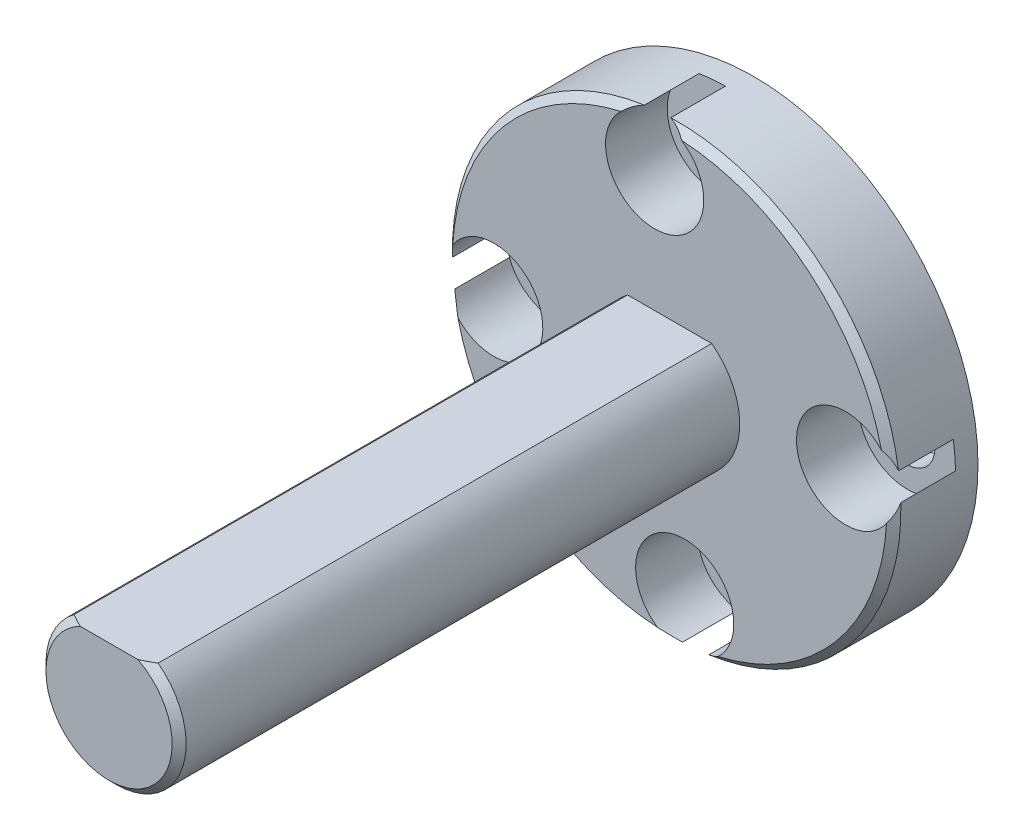
ISO-10303-21;
HEADER;
FILE_DESCRIPTION(('STEP AP214'),'2;1');
FILE_NAME('part.step','',(''),(''),'','','');
FILE_SCHEMA(('AUTOMOTIVE_DESIGN { 1 0 10303 214 1 1 1 1 }'));
ENDSEC;
DATA;
#1=APPLICATION_CONTEXT('core data for automotive mechanical design processes');
#2=APPLICATION_PROTOCOL_DEFINITION('international standard','automotive_design',2000,#1);
#3=PRODUCT_CONTEXT('',#1,'mechanical');
#4=PRODUCT('Part','Part','',(#3));
#5=PRODUCT_RELATED_PRODUCT_CATEGORY('part','',(#4));
#6=PRODUCT_DEFINITION_FORMATION('','',#4);
#7=PRODUCT_DEFINITION_CONTEXT('part definition',#1,'design');
#8=PRODUCT_DEFINITION('design','',#6,#7);
#9=PRODUCT_DEFINITION_SHAPE('','',#8);
#10=(LENGTH_UNIT() NAMED_UNIT(*) SI_UNIT(.MILLI.,.METRE.));
#11=(NAMED_UNIT(*) PLANE_ANGLE_UNIT() SI_UNIT($,.RADIAN.));
#12=(NAMED_UNIT(*) SI_UNIT($,.STERADIAN.) SOLID_ANGLE_UNIT());
#13=UNCERTAINTY_MEASURE_WITH_UNIT(LENGTH_MEASURE(1.E-05),#10,'distance_accuracy_value','');
#14=(GEOMETRIC_REPRESENTATION_CONTEXT(3) GLOBAL_UNCERTAINTY_ASSIGNED_CONTEXT((#13)) GLOBAL_UNIT_ASSIGNED_CONTEXT((#10,
#11,#12)) REPRESENTATION_CONTEXT('',''));
#15=CARTESIAN_POINT('',(0.,0.,0.));
#16=DIRECTION('',(0.,0.,1.));
#17=DIRECTION('',(1.,0.,0.));
#18=AXIS2_PLACEMENT_3D('',#15,#16,#17);
#19=CARTESIAN_POINT('',(8.5894589271742,-9.33447774890565,3.81));
#20=DIRECTION('',(0.,0.,-1.));
#21=DIRECTION('',(-1.,0.,0.));
#22=AXIS2_PLACEMENT_3D('',#19,#20,#21);
#23=CYLINDRICAL_SURFACE('',#22,1.25);
#24=CARTESIAN_POINT('',(8.5894589271742,-9.33447774890565,0.));
#25=DIRECTION('',(0.,0.,1.));
#26=DIRECTION('',(1.,0.,0.));
#27=AXIS2_PLACEMENT_3D('',#24,#25,#26);
#28=CIRCLE('',#27,1.25);
#29=CARTESIAN_POINT('',(9.8394589271742,-9.33447774890565,0.));
#30=VERTEX_POINT('',#29);
#31=EDGE_CURVE('E380',#30,#30,#28,.T.);
#32=ORIENTED_EDGE('',*,*,#31,.F.);
#33=EDGE_LOOP('',(#32));
#34=FACE_BOUND('',#33,.T.);
#35=CARTESIAN_POINT('',(8.5894589271742,-9.33447774890565,1.016));
#36=DIRECTION('',(0.,0.,1.));
#37=DIRECTION('',(1.,0.,0.));
#38=AXIS2_PLACEMENT_3D('',#35,#36,#37);
#39=CIRCLE('',#38,1.25);
#40=CARTESIAN_POINT('',(9.8394589271742,-9.33447774890565,1.016));
#41=VERTEX_POINT('',#40);
#42=EDGE_CURVE('E46',#41,#41,#39,.T.);
#43=ORIENTED_EDGE('',*,*,#42,.T.);
#44=EDGE_LOOP('',(#43));
#45=FACE_BOUND('',#44,.T.);
#46=ADVANCED_FACE('F40',(#34,#45),#23,.F.);
#47=CARTESIAN_POINT('',(1.29894533631494,-17.9859753985324,3.81));
#48=DIRECTION('',(0.,0.,-1.));
#49=DIRECTION('',(-1.,0.,0.));
#50=AXIS2_PLACEMENT_3D('',#47,#48,#49);
#51=CYLINDRICAL_SURFACE('',#50,1.25);
#52=CARTESIAN_POINT('',(1.29894533631494,-17.9859753985324,0.));
#53=DIRECTION('',(0.,0.,1.));
#54=DIRECTION('',(1.,0.,0.));
#55=AXIS2_PLACEMENT_3D('',#52,#53,#54);
#56=CIRCLE('',#55,1.25);
#57=CARTESIAN_POINT('',(2.54894533631494,-17.9859753985324,0.));
#58=VERTEX_POINT('',#57);
#59=EDGE_CURVE('E378',#58,#58,#56,.T.);
#60=ORIENTED_EDGE('',*,*,#59,.F.);
#61=EDGE_LOOP('',(#60));
#62=FACE_BOUND('',#61,.T.);
#63=CARTESIAN_POINT('',(1.29894533631494,-17.9859753985324,1.016));
#64=DIRECTION('',(0.,0.,1.));
#65=DIRECTION('',(1.,0.,0.));
#66=AXIS2_PLACEMENT_3D('',#63,#64,#65);
#67=CIRCLE('',#66,1.25);
#68=CARTESIAN_POINT('',(2.54894533631494,-17.9859753985324,1.016));
#69=VERTEX_POINT('',#68);
#70=EDGE_CURVE('E428',#69,#69,#67,.T.);
#71=ORIENTED_EDGE('',*,*,#70,.T.);
#72=EDGE_LOOP('',(#71));
#73=FACE_BOUND('',#72,.T.);
#74=ADVANCED_FACE('F231',(#62,#73),#51,.F.);
#75=CARTESIAN_POINT('',(-7.35255231331176,-10.6954618076731,3.81));
#76=DIRECTION('',(0.,0.,-1.));
#77=DIRECTION('',(-1.,0.,0.));
#78=AXIS2_PLACEMENT_3D('',#75,#76,#77);
#79=CYLINDRICAL_SURFACE('',#78,1.25);
#80=CARTESIAN_POINT('',(-7.35255231331176,-10.6954618076731,0.));
#81=DIRECTION('',(0.,0.,1.));
#82=DIRECTION('',(1.,0.,0.));
#83=AXIS2_PLACEMENT_3D('',#80,#81,#82);
#84=CIRCLE('',#83,1.25);
#85=CARTESIAN_POINT('',(-6.10255231331177,-10.6954618076731,0.));
#86=VERTEX_POINT('',#85);
#87=EDGE_CURVE('E375',#86,#86,#84,.T.);
#88=ORIENTED_EDGE('',*,*,#87,.F.);
#89=EDGE_LOOP('',(#88));
#90=FACE_BOUND('',#89,.T.);
#91=CARTESIAN_POINT('',(-7.35255231331176,-10.6954618076731,1.016));
#92=DIRECTION('',(0.,0.,1.));
#93=DIRECTION('',(1.,0.,0.));
#94=AXIS2_PLACEMENT_3D('',#91,#92,#93);
#95=CIRCLE('',#94,1.25);
#96=CARTESIAN_POINT('',(-6.10255231331177,-10.6954618076731,1.016));
#97=VERTEX_POINT('',#96);
#98=EDGE_CURVE('E425',#97,#97,#95,.T.);
#99=ORIENTED_EDGE('',*,*,#98,.T.);
#100=EDGE_LOOP('',(#99));
#101=FACE_BOUND('',#100,.T.);
#102=ADVANCED_FACE('F227',(#90,#101),#79,.F.);
#103=CARTESIAN_POINT('',(-0.0620387224524936,-2.04396415804638,3.81));
#104=DIRECTION('',(0.,0.,-1.));
#105=DIRECTION('',(-1.,0.,0.));
#106=AXIS2_PLACEMENT_3D('',#103,#104,#105);
#107=CYLINDRICAL_SURFACE('',#106,1.25000000000001);
#108=CARTESIAN_POINT('',(-0.0620387224524936,-2.04396415804638,0.));
#109=DIRECTION('',(0.,0.,1.));
#110=DIRECTION('',(1.,0.,0.));
#111=AXIS2_PLACEMENT_3D('',#108,#109,#110);
#112=CIRCLE('',#111,1.25000000000001);
#113=CARTESIAN_POINT('',(1.18796127754751,-2.04396415804638,0.));
#114=VERTEX_POINT('',#113);
#115=EDGE_CURVE('E372',#114,#114,#112,.T.);
#116=ORIENTED_EDGE('',*,*,#115,.F.);
#117=EDGE_LOOP('',(#116));
#118=FACE_BOUND('',#117,.T.);
#119=CARTESIAN_POINT('',(-0.0620387224524936,-2.04396415804638,1.016));
#120=DIRECTION('',(0.,0.,1.));
#121=DIRECTION('',(1.,0.,0.));
#122=AXIS2_PLACEMENT_3D('',#119,#120,#121);
#123=CIRCLE('',#122,1.25000000000001);
#124=CARTESIAN_POINT('',(1.18796127754751,-2.04396415804638,1.016));
#125=VERTEX_POINT('',#124);
#126=EDGE_CURVE('E422',#125,#125,#123,.T.);
#127=ORIENTED_EDGE('',*,*,#126,.T.);
#128=EDGE_LOOP('',(#127));
#129=FACE_BOUND('',#128,.T.);
#130=ADVANCED_FACE('F223',(#118,#129),#107,.F.);
#131=CARTESIAN_POINT('',(0.618453306931221,-10.0149697782894,3.81));
#132=DIRECTION('',(0.,0.,-1.));
#133=DIRECTION('',(-1.,0.,0.));
#134=AXIS2_PLACEMENT_3D('',#131,#132,#133);
#135=CONICAL_SURFACE('',#134,9.84250000000002,0.785398163397448);
#136=CARTESIAN_POINT('',(1.1640256342109,-0.187802326489887,3.8102));
#137=CARTESIAN_POINT('',(1.12017829746812,-0.158834261006519,3.78370758090818));
#138=CARTESIAN_POINT('',(1.07484772937672,-0.131128931908331,3.75824307108198));
#139=CARTESIAN_POINT('',(0.981317436250748,-0.0785492170982156,3.70957096829359));
#140=CARTESIAN_POINT('',(0.933113667285822,-0.0536789721353768,3.68636668349146));
#141=CARTESIAN_POINT('',(0.835034276245786,-0.00761720253918871,3.64292469568719));
#142=CARTESIAN_POINT('',(0.785210074274242,0.0136369723693549,3.62263768462013));
#143=CARTESIAN_POINT('',(0.683292966126166,0.0527059604053601,3.58474537228036));
#144=CARTESIAN_POINT('',(0.63120215324661,0.0705238677561921,3.56713766144686));
#145=CARTESIAN_POINT('',(0.541410494604428,0.0975047216196187,3.53979848589234));
#146=CARTESIAN_POINT('',(0.504228214472002,0.107641917559464,3.52931301025608));
#147=CARTESIAN_POINT('',(0.428772187866637,0.126104063641961,3.50972265489644));
#148=CARTESIAN_POINT('',(0.390492710080454,0.134416126067248,3.50062772283103));
#149=CARTESIAN_POINT('',(0.35184990059251,0.141731785885865,3.49230000000055));
#150=B_SPLINE_CURVE_WITH_KNOTS('',3,(#136,#137,#138,#139,#140,#141,#142,#143,#144,#145,#146,
#147,#148,#149),.UNSPECIFIED.,.F.,.F.,(4,2,2,2,2,2,4),(0.,0.17654759345137,0.353349824287093,
0.526680091351421,0.699853545048763,0.819600348174526,0.940167304654201),.UNSPECIFIED.);
#151=CARTESIAN_POINT('',(1.16369449773567,-0.187583640874666,3.81));
#152=VERTEX_POINT('',#151);
#153=CARTESIAN_POINT('',(0.352777064142094,0.141556012256216,3.49250000000002));
#154=VERTEX_POINT('',#153);
#155=EDGE_CURVE('E11',#152,#154,#150,.T.);
#156=ORIENTED_EDGE('',*,*,#155,.F.);
#157=CARTESIAN_POINT('',(0.618453306931221,-10.0149697782894,3.81));
#158=DIRECTION('',(0.,0.,1.));
#159=DIRECTION('',(1.,0.,0.));
#160=AXIS2_PLACEMENT_3D('',#157,#158,#159);
#161=CIRCLE('',#160,9.84250000000002);
#162=CARTESIAN_POINT('',(10.2112062491294,-7.81181357866361,3.81));
#163=VERTEX_POINT('',#162);
#164=EDGE_CURVE('E180',#163,#152,#161,.T.);
#165=ORIENTED_EDGE('',*,*,#164,.F.);
#166=CARTESIAN_POINT('',(10.6733690592424,-8.5560889559036,3.49230000000002));
#167=CARTESIAN_POINT('',(10.6532167468639,-8.5021085458024,3.50449551006156));
#168=CARTESIAN_POINT('',(10.6310798132591,-8.44926742252285,3.51834469775761));
#169=CARTESIAN_POINT('',(10.5832213276798,-8.34619829643955,3.54911313240565));
#170=CARTESIAN_POINT('',(10.5575017111737,-8.29596890269156,3.56603072319863));
#171=CARTESIAN_POINT('',(10.503327007961,-8.19926833423461,3.60238546905063));
#172=CARTESIAN_POINT('',(10.4749288318518,-8.15274614003993,3.62177235565336));
#173=CARTESIAN_POINT('',(10.4153919757244,-8.06268733297368,3.66305916029872));
#174=CARTESIAN_POINT('',(10.3842540282047,-8.01914992760122,3.6849584071158));
#175=CARTESIAN_POINT('',(10.3295710559645,-7.94814319924356,3.72393058504314));
#176=CARTESIAN_POINT('',(10.3066475679641,-7.91986087615851,3.740407871505));
#177=CARTESIAN_POINT('',(10.2596210820727,-7.86462987903551,3.77449177156395));
#178=CARTESIAN_POINT('',(10.2355115423436,-7.83769076893989,3.79210486742477));
#179=CARTESIAN_POINT('',(10.2109345983339,-7.81152430265548,3.81019999999991));
#180=B_SPLINE_CURVE_WITH_KNOTS('',3,(#166,#167,#168,#169,#170,#171,#172,#173,#174,#175,#176,
#177,#178,#179),.UNSPECIFIED.,.F.,.F.,(4,2,2,2,2,2,4),(0.,0.176588464337086,0.353081897831783,
0.526430354024874,0.699732604213972,0.819563878990922,0.940152885378371),.UNSPECIFIED.);
#181=CARTESIAN_POINT('',(10.6730386690336,-8.5552050040207,3.49250000000002));
#182=VERTEX_POINT('',#181);
#183=EDGE_CURVE('E283',#182,#163,#180,.T.);
#184=ORIENTED_EDGE('',*,*,#183,.F.);
#185=CARTESIAN_POINT('',(0.618453306931221,-10.0149697782894,3.49250000000002));
#186=DIRECTION('',(0.,0.,1.));
#187=DIRECTION('',(1.,0.,0.));
#188=AXIS2_PLACEMENT_3D('',#185,#186,#187);
#189=CIRCLE('',#188,10.16);
#190=EDGE_CURVE('E191',#154,#182,#189,.F.);
#191=ORIENTED_EDGE('',*,*,#190,.F.);
#192=EDGE_LOOP('',(#156,#165,#184,#191));
#193=FACE_BOUND('',#192,.T.);
#194=ADVANCED_FACE('F226',(#193),#135,.T.);
#195=CARTESIAN_POINT('',(10.4456207587306,-10.5605421055693,3.81020000000012));
#196=CARTESIAN_POINT('',(10.4745888242139,-10.5166947688265,3.7837075809083));
#197=CARTESIAN_POINT('',(10.5022941533121,-10.4713642007351,3.7582430710821));
#198=CARTESIAN_POINT('',(10.5548738681222,-10.3778339076092,3.70957096829372));
#199=CARTESIAN_POINT('',(10.5797441130851,-10.3296301386443,3.68636668349158));
#200=CARTESIAN_POINT('',(10.6258058826813,-10.2315507476043,3.64292469568732));
#201=CARTESIAN_POINT('',(10.6470600575898,-10.1817265456327,3.62263768462026));
#202=CARTESIAN_POINT('',(10.6861290456258,-10.0798094374847,3.58474537228048));
#203=CARTESIAN_POINT('',(10.7039469529766,-10.0277186246052,3.56713766144698));
#204=CARTESIAN_POINT('',(10.7309278068402,-9.93792696596255,3.53979848589232));
#205=CARTESIAN_POINT('',(10.7410650027802,-9.90074468582966,3.52931301025593));
#206=CARTESIAN_POINT('',(10.7595271488629,-9.82528865922334,3.50972265489608));
#207=CARTESIAN_POINT('',(10.7678392112882,-9.78700918143667,3.50062772283057));
#208=CARTESIAN_POINT('',(10.7751548711069,-9.74836637194823,3.49230000000001));
#209=B_SPLINE_CURVE_WITH_KNOTS('',3,(#195,#196,#197,#198,#199,#200,#201,#202,#203,#204,#205,
#206,#207,#208),.UNSPECIFIED.,.F.,.F.,(4,2,2,2,2,2,4),(0.,0.176547593451327,0.353349824287008,
0.526680091351286,0.699853545048573,0.81960034817582,0.940167304657005),.UNSPECIFIED.);
#210=CARTESIAN_POINT('',(10.4458394443459,-10.5602109690938,3.81));
#211=VERTEX_POINT('',#210);
#212=CARTESIAN_POINT('',(10.7749790974768,-9.74929353550027,3.49250000000002));
#213=VERTEX_POINT('',#212);
#214=EDGE_CURVE('E290',#211,#213,#209,.T.);
#215=ORIENTED_EDGE('',*,*,#214,.F.);
#216=CARTESIAN_POINT('',(2.82160950655698,-19.6077227204875,3.81));
#217=VERTEX_POINT('',#216);
#218=EDGE_CURVE('E184',#217,#211,#161,.T.);
#219=ORIENTED_EDGE('',*,*,#218,.F.);
#220=CARTESIAN_POINT('',(2.07733412931701,-20.0698855306005,3.49230000000002));
#221=CARTESIAN_POINT('',(2.13131453941821,-20.049733218222,3.50449551006156));
#222=CARTESIAN_POINT('',(2.18415566269775,-20.0275962846173,3.51834469775761));
#223=CARTESIAN_POINT('',(2.28722478878105,-19.979737799038,3.54911313240565));
#224=CARTESIAN_POINT('',(2.33745418252905,-19.9540181825318,3.56603072319864));
#225=CARTESIAN_POINT('',(2.43415475098599,-19.8998434793192,3.60238546905064));
#226=CARTESIAN_POINT('',(2.48067694518068,-19.8714453032099,3.62177235565336));
#227=CARTESIAN_POINT('',(2.57073575224693,-19.8119084470825,3.66305916029872));
#228=CARTESIAN_POINT('',(2.61427315761938,-19.7807704995629,3.68495840711581));
#229=CARTESIAN_POINT('',(2.68527988597704,-19.7260875273227,3.72393058504315));
#230=CARTESIAN_POINT('',(2.71356220906209,-19.7031640393223,3.740407871505));
#231=CARTESIAN_POINT('',(2.76879320618509,-19.6561375534308,3.77449177156395));
#232=CARTESIAN_POINT('',(2.79573231628071,-19.6320280137018,3.79210486742477));
#233=CARTESIAN_POINT('',(2.82189878256512,-19.6074510696921,3.81019999999991));
#234=B_SPLINE_CURVE_WITH_KNOTS('',3,(#220,#221,#222,#223,#224,#225,#226,#227,#228,#229,#230,
#231,#232,#233),.UNSPECIFIED.,.F.,.F.,(4,2,2,2,2,2,4),(0.,0.176588464337088,0.353081897831783,
0.526430354024878,0.699732604213974,0.819563878990917,0.940152885378361),.UNSPECIFIED.);
#235=CARTESIAN_POINT('',(2.07821808119992,-20.0695551403918,3.49250000000002));
#236=VERTEX_POINT('',#235);
#237=EDGE_CURVE('E173',#236,#217,#234,.T.);
#238=ORIENTED_EDGE('',*,*,#237,.F.);
#239=EDGE_CURVE('E183',#213,#236,#189,.F.);
#240=ORIENTED_EDGE('',*,*,#239,.F.);
#241=EDGE_LOOP('',(#215,#219,#238,#240));
#242=FACE_BOUND('',#241,.T.);
#243=ADVANCED_FACE('F397',(#242),#135,.T.);
#244=CARTESIAN_POINT('',(0.0728809796513328,-19.8421372300887,3.81020000000012));
#245=CARTESIAN_POINT('',(0.116728316394096,-19.8711052955721,3.7837075809083));
#246=CARTESIAN_POINT('',(0.162058884485485,-19.8988106246703,3.7582430710821));
#247=CARTESIAN_POINT('',(0.25558917761142,-19.9513903394804,3.70957096829372));
#248=CARTESIAN_POINT('',(0.30379294657633,-19.9762605844432,3.68636668349158));
#249=CARTESIAN_POINT('',(0.401872337616329,-20.0223223540394,3.64292469568732));
#250=CARTESIAN_POINT('',(0.451696539587853,-20.0435765289479,3.62263768462026));
#251=CARTESIAN_POINT('',(0.553613647735887,-20.082645516984,3.58474537228048));
#252=CARTESIAN_POINT('',(0.605704460615421,-20.1004634243348,3.56713766144698));
#253=CARTESIAN_POINT('',(0.695496119258031,-20.1274442781984,3.53979848589232));
#254=CARTESIAN_POINT('',(0.732678399390919,-20.1375814741383,3.52931301025593));
#255=CARTESIAN_POINT('',(0.808134425997234,-20.156043620221,3.50972265489608));
#256=CARTESIAN_POINT('',(0.846413903783905,-20.1643556826464,3.50062772283057));
#257=CARTESIAN_POINT('',(0.885056713272345,-20.1716713424651,3.49230000000001));
#258=B_SPLINE_CURVE_WITH_KNOTS('',3,(#244,#245,#246,#247,#248,#249,#250,#251,#252,#253,#254,
#255,#256,#257),.UNSPECIFIED.,.F.,.F.,(4,2,2,2,2,2,4),(0.,0.176547593451328,0.353349824287009,
0.526680091351287,0.699853545048575,0.819600348175817,0.940167304656993),.UNSPECIFIED.);
#259=CARTESIAN_POINT('',(0.0732121161267521,-19.8423559157041,3.81));
#260=VERTEX_POINT('',#259);
#261=CARTESIAN_POINT('',(0.8841295497203,-20.1714955688349,3.49250000000002));
#262=VERTEX_POINT('',#261);
#263=EDGE_CURVE('E276',#260,#262,#258,.T.);
#264=ORIENTED_EDGE('',*,*,#263,.F.);
#265=CARTESIAN_POINT('',(-8.97429963526691,-12.2181259779151,3.81));
#266=VERTEX_POINT('',#265);
#267=EDGE_CURVE('E181',#266,#260,#161,.T.);
#268=ORIENTED_EDGE('',*,*,#267,.F.);
#269=CARTESIAN_POINT('',(-9.43646244537993,-11.4738506006752,3.49230000000002));
#270=CARTESIAN_POINT('',(-9.41631013300142,-11.5278310107763,3.50449551006156));
#271=CARTESIAN_POINT('',(-9.39417319939669,-11.5806721340559,3.51834469775761));
#272=CARTESIAN_POINT('',(-9.34631471381737,-11.6837412601392,3.54911313240565));
#273=CARTESIAN_POINT('',(-9.32059509731124,-11.7339706538872,3.56603072319864));
#274=CARTESIAN_POINT('',(-9.26642039409859,-11.8306712223441,3.60238546905064));
#275=CARTESIAN_POINT('',(-9.23802221798936,-11.8771934165388,3.62177235565336));
#276=CARTESIAN_POINT('',(-9.17848536186194,-11.9672522236051,3.66305916029872));
#277=CARTESIAN_POINT('',(-9.14734741434228,-12.0107896289775,3.6849584071158));
#278=CARTESIAN_POINT('',(-9.09266444210207,-12.0817963573352,3.72393058504315));
#279=CARTESIAN_POINT('',(-9.06974095410167,-12.1100786804202,3.740407871505));
#280=CARTESIAN_POINT('',(-9.02271446821021,-12.1653096775432,3.77449177156394));
#281=CARTESIAN_POINT('',(-8.99860492848118,-12.1922487876389,3.79210486742477));
#282=CARTESIAN_POINT('',(-8.97402798447147,-12.2184152539233,3.81019999999991));
#283=B_SPLINE_CURVE_WITH_KNOTS('',3,(#269,#270,#271,#272,#273,#274,#275,#276,#277,#278,#279,
#280,#281,#282),.UNSPECIFIED.,.F.,.F.,(4,2,2,2,2,2,4),(0.,0.176588464337087,0.353081897831783,
0.526430354024873,0.699732604213971,0.819563878990918,0.940152885378366),.UNSPECIFIED.);
#284=CARTESIAN_POINT('',(-9.4361320551712,-11.4747345525581,3.49250000000002));
#285=VERTEX_POINT('',#284);
#286=EDGE_CURVE('E158',#285,#266,#283,.T.);
#287=ORIENTED_EDGE('',*,*,#286,.F.);
#288=EDGE_CURVE('E192',#262,#285,#189,.F.);
#289=ORIENTED_EDGE('',*,*,#288,.F.);
#290=EDGE_LOOP('',(#264,#268,#287,#289));
#291=FACE_BOUND('',#290,.T.);
#292=ADVANCED_FACE('F242',(#291),#135,.T.);
#293=CARTESIAN_POINT('',(0.618453306931221,-10.0149697782894,3.81));
#294=DIRECTION('',(0.,0.,1.));
#295=DIRECTION('',(1.,0.,0.));
#296=AXIS2_PLACEMENT_3D('',#293,#294,#295);
#297=PLANE('',#296);
#298=CARTESIAN_POINT('',(-0.0620387224524936,-2.04396415804638,3.81));
#299=DIRECTION('',(0.,0.,1.));
#300=DIRECTION('',(1.,0.,0.));
#301=AXIS2_PLACEMENT_3D('',#298,#299,#300);
#302=CIRCLE('',#301,2.22453827829678);
#303=CARTESIAN_POINT('',(-1.58470289269453,-0.422216836091224,3.81));
#304=VERTEX_POINT('',#303);
#305=EDGE_CURVE('E179',#304,#152,#302,.T.);
#306=ORIENTED_EDGE('',*,*,#305,.F.);
#307=CARTESIAN_POINT('',(-9.20893283048347,-9.46972858748491,3.81));
#308=VERTEX_POINT('',#307);
#309=EDGE_CURVE('E170',#304,#308,#161,.T.);
#310=ORIENTED_EDGE('',*,*,#309,.T.);
#311=CARTESIAN_POINT('',(-7.35255231331176,-10.6954618076731,3.81));
#312=DIRECTION('',(0.,0.,1.));
#313=DIRECTION('',(1.,0.,0.));
#314=AXIS2_PLACEMENT_3D('',#311,#312,#313);
#315=CIRCLE('',#314,2.22453827829678);
#316=EDGE_CURVE('E151',#266,#308,#315,.T.);
#317=ORIENTED_EDGE('',*,*,#316,.F.);
#318=ORIENTED_EDGE('',*,*,#267,.T.);
#319=CARTESIAN_POINT('',(1.29894533631494,-17.9859753985324,3.81));
#320=DIRECTION('',(0.,0.,1.));
#321=DIRECTION('',(1.,0.,0.));
#322=AXIS2_PLACEMENT_3D('',#319,#320,#321);
#323=CIRCLE('',#322,2.22453827829678);
#324=EDGE_CURVE('E393',#217,#260,#323,.T.);
#325=ORIENTED_EDGE('',*,*,#324,.F.);
#326=ORIENTED_EDGE('',*,*,#218,.T.);
#327=CARTESIAN_POINT('',(8.5894589271742,-9.33447774890565,3.81));
#328=DIRECTION('',(0.,0.,1.));
#329=DIRECTION('',(1.,0.,0.));
#330=AXIS2_PLACEMENT_3D('',#327,#328,#329);
#331=CIRCLE('',#330,2.22453827829678);
#332=EDGE_CURVE('E391',#163,#211,#331,.T.);
#333=ORIENTED_EDGE('',*,*,#332,.F.);
#334=ORIENTED_EDGE('',*,*,#164,.T.);
#335=EDGE_LOOP('',(#306,#310,#317,#318,#325,#326,#333,#334));
#336=FACE_BOUND('',#335,.T.);
#337=DIRECTION('',(-1.,0.,0.));
#338=VECTOR('',#337,1.);
#339=CARTESIAN_POINT('',(-1.28654669306878,-7.47496977828936,3.81));
#340=LINE('',#339,#338);
#341=CARTESIAN_POINT('',(2.52345330693122,-7.47496977828936,3.81));
#342=VERTEX_POINT('',#341);
#343=CARTESIAN_POINT('',(-1.28654669306878,-7.47496977828936,3.81));
#344=VERTEX_POINT('',#343);
#345=EDGE_CURVE('E364',#342,#344,#340,.T.);
#346=ORIENTED_EDGE('',*,*,#345,.F.);
#347=CARTESIAN_POINT('',(0.618453306931221,-10.0149697782894,3.81));
#348=DIRECTION('',(0.,0.,1.));
#349=DIRECTION('',(1.,0.,0.));
#350=AXIS2_PLACEMENT_3D('',#347,#348,#349);
#351=CIRCLE('',#350,3.175);
#352=EDGE_CURVE('E356',#344,#342,#351,.T.);
#353=ORIENTED_EDGE('',*,*,#352,.F.);
#354=EDGE_LOOP('',(#346,#353));
#355=FACE_BOUND('',#354,.T.);
#356=ADVANCED_FACE('F176',(#336,#355),#297,.T.);
#357=CARTESIAN_POINT('',(0.618453306931221,-10.0149697782894,0.));
#358=DIRECTION('',(0.,0.,1.));
#359=DIRECTION('',(1.,0.,0.));
#360=AXIS2_PLACEMENT_3D('',#357,#358,#359);
#361=PLANE('',#360);
#362=CARTESIAN_POINT('',(0.618453306931221,-10.0149697782894,0.));
#363=DIRECTION('',(0.,0.,-1.));
#364=DIRECTION('',(-1.,0.,0.));
#365=AXIS2_PLACEMENT_3D('',#362,#363,#364);
#366=CIRCLE('',#365,4.445);
#367=CARTESIAN_POINT('',(-3.82654669306878,-10.0149697782894,0.));
#368=VERTEX_POINT('',#367);
#369=EDGE_CURVE('E353',#368,#368,#366,.T.);
#370=ORIENTED_EDGE('',*,*,#369,.F.);
#371=EDGE_LOOP('',(#370));
#372=FACE_BOUND('',#371,.T.);
#373=CARTESIAN_POINT('',(0.618453306931221,-10.0149697782894,0.));
#374=DIRECTION('',(0.,0.,1.));
#375=DIRECTION('',(1.,0.,0.));
#376=AXIS2_PLACEMENT_3D('',#373,#374,#375);
#377=CIRCLE('',#376,10.16);
#378=CARTESIAN_POINT('',(10.7784533069312,-10.0149697782894,0.));
#379=VERTEX_POINT('',#378);
#380=EDGE_CURVE('E187',#379,#379,#377,.T.);
#381=ORIENTED_EDGE('',*,*,#380,.F.);
#382=EDGE_LOOP('',(#381));
#383=FACE_BOUND('',#382,.T.);
#384=ORIENTED_EDGE('',*,*,#31,.T.);
#385=EDGE_LOOP('',(#384));
#386=FACE_BOUND('',#385,.T.);
#387=ORIENTED_EDGE('',*,*,#59,.T.);
#388=EDGE_LOOP('',(#387));
#389=FACE_BOUND('',#388,.T.);
#390=ORIENTED_EDGE('',*,*,#87,.T.);
#391=EDGE_LOOP('',(#390));
#392=FACE_BOUND('',#391,.T.);
#393=ORIENTED_EDGE('',*,*,#115,.T.);
#394=EDGE_LOOP('',(#393));
#395=FACE_BOUND('',#394,.T.);
#396=ADVANCED_FACE('F241',(#372,#383,#386,#389,#392,#395),#361,.F.);
#397=CARTESIAN_POINT('',(0.618453306931221,-10.0149697782894,3.81));
#398=DIRECTION('',(0.,0.,-1.));
#399=DIRECTION('',(-1.,0.,0.));
#400=AXIS2_PLACEMENT_3D('',#397,#398,#399);
#401=CYLINDRICAL_SURFACE('',#400,10.16);
#402=CARTESIAN_POINT('',(0.618453306931221,-10.0149697782894,1.016));
#403=DIRECTION('',(0.,0.,1.));
#404=DIRECTION('',(1.,0.,0.));
#405=AXIS2_PLACEMENT_3D('',#402,#403,#404);
#406=CIRCLE('',#405,10.16);
#407=CARTESIAN_POINT('',(0.352777064142098,0.141556012256215,1.016));
#408=VERTEX_POINT('',#407);
#409=CARTESIAN_POINT('',(-0.841311467337429,0.039615583813065,1.016));
#410=VERTEX_POINT('',#409);
#411=EDGE_CURVE('E423',#408,#410,#406,.T.);
#412=ORIENTED_EDGE('',*,*,#411,.F.);
#413=DIRECTION('',(0.,0.,1.));
#414=VECTOR('',#413,1.);
#415=CARTESIAN_POINT('',(0.352777064142099,0.141556012256214,2.413));
#416=LINE('',#415,#414);
#417=EDGE_CURVE('E419',#408,#154,#416,.T.);
#418=ORIENTED_EDGE('',*,*,#417,.T.);
#419=ORIENTED_EDGE('',*,*,#190,.T.);
#420=DIRECTION('',(0.,0.,1.));
#421=VECTOR('',#420,1.);
#422=CARTESIAN_POINT('',(10.6730386690336,-8.5552050040207,2.413));
#423=LINE('',#422,#421);
#424=CARTESIAN_POINT('',(10.6730386690336,-8.5552050040207,1.016));
#425=VERTEX_POINT('',#424);
#426=EDGE_CURVE('E59',#182,#425,#423,.F.);
#427=ORIENTED_EDGE('',*,*,#426,.T.);
#428=CARTESIAN_POINT('',(0.618453306931221,-10.0149697782894,1.016));
#429=DIRECTION('',(0.,0.,1.));
#430=DIRECTION('',(1.,0.,0.));
#431=AXIS2_PLACEMENT_3D('',#428,#429,#430);
#432=CIRCLE('',#431,10.16);
#433=CARTESIAN_POINT('',(10.7749790974768,-9.74929353550027,1.016));
#434=VERTEX_POINT('',#433);
#435=EDGE_CURVE('E354',#434,#425,#432,.T.);
#436=ORIENTED_EDGE('',*,*,#435,.F.);
#437=DIRECTION('',(0.,0.,1.));
#438=VECTOR('',#437,1.);
#439=CARTESIAN_POINT('',(10.7749790974768,-9.74929353550027,2.413));
#440=LINE('',#439,#438);
#441=EDGE_CURVE('E416',#434,#213,#440,.T.);
#442=ORIENTED_EDGE('',*,*,#441,.T.);
#443=ORIENTED_EDGE('',*,*,#239,.T.);
#444=DIRECTION('',(0.,0.,1.));
#445=VECTOR('',#444,1.);
#446=CARTESIAN_POINT('',(2.07821808119993,-20.0695551403918,2.413));
#447=LINE('',#446,#445);
#448=CARTESIAN_POINT('',(2.07821808119992,-20.0695551403918,1.016));
#449=VERTEX_POINT('',#448);
#450=EDGE_CURVE('E404',#236,#449,#447,.F.);
#451=ORIENTED_EDGE('',*,*,#450,.T.);
#452=CARTESIAN_POINT('',(0.618453306931221,-10.0149697782894,1.016));
#453=DIRECTION('',(0.,0.,1.));
#454=DIRECTION('',(1.,0.,0.));
#455=AXIS2_PLACEMENT_3D('',#452,#453,#454);
#456=CIRCLE('',#455,10.16);
#457=CARTESIAN_POINT('',(0.884129549720296,-20.1714955688349,1.016));
#458=VERTEX_POINT('',#457);
#459=EDGE_CURVE('E429',#458,#449,#456,.T.);
#460=ORIENTED_EDGE('',*,*,#459,.F.);
#461=DIRECTION('',(0.,0.,1.));
#462=VECTOR('',#461,1.);
#463=CARTESIAN_POINT('',(0.884129549720285,-20.1714955688349,2.413));
#464=LINE('',#463,#462);
#465=EDGE_CURVE('E407',#458,#262,#464,.T.);
#466=ORIENTED_EDGE('',*,*,#465,.T.);
#467=ORIENTED_EDGE('',*,*,#288,.T.);
#468=DIRECTION('',(0.,0.,1.));
#469=VECTOR('',#468,1.);
#470=CARTESIAN_POINT('',(-9.43613205517119,-11.4747345525581,2.413));
#471=LINE('',#470,#469);
#472=CARTESIAN_POINT('',(-9.4361320551712,-11.4747345525581,1.016));
#473=VERTEX_POINT('',#472);
#474=EDGE_CURVE('E411',#285,#473,#471,.F.);
#475=ORIENTED_EDGE('',*,*,#474,.T.);
#476=CARTESIAN_POINT('',(0.618453306931221,-10.0149697782894,1.016));
#477=DIRECTION('',(0.,0.,1.));
#478=DIRECTION('',(1.,0.,0.));
#479=AXIS2_PLACEMENT_3D('',#476,#477,#478);
#480=CIRCLE('',#479,10.16);
#481=CARTESIAN_POINT('',(-9.53807248361436,-10.2806460210785,1.016));
#482=VERTEX_POINT('',#481);
#483=EDGE_CURVE('E426',#482,#473,#480,.T.);
#484=ORIENTED_EDGE('',*,*,#483,.F.);
#485=DIRECTION('',(0.,0.,1.));
#486=VECTOR('',#485,1.);
#487=CARTESIAN_POINT('',(-9.53807248361435,-10.2806460210784,2.413));
#488=LINE('',#487,#486);
#489=CARTESIAN_POINT('',(-9.53807248361436,-10.2806460210785,3.49250000000002));
#490=VERTEX_POINT('',#489);
#491=EDGE_CURVE('E408',#482,#490,#488,.T.);
#492=ORIENTED_EDGE('',*,*,#491,.T.);
#493=CARTESIAN_POINT('',(-0.841311467337429,0.0396155838130654,3.49250000000002));
#494=VERTEX_POINT('',#493);
#495=EDGE_CURVE('E172',#490,#494,#189,.F.);
#496=ORIENTED_EDGE('',*,*,#495,.T.);
#497=DIRECTION('',(0.,0.,1.));
#498=VECTOR('',#497,1.);
#499=CARTESIAN_POINT('',(-0.84131146733743,0.0396155838130645,2.413));
#500=LINE('',#499,#498);
#501=EDGE_CURVE('E67',#494,#410,#500,.F.);
#502=ORIENTED_EDGE('',*,*,#501,.T.);
#503=EDGE_LOOP('',(#412,#418,#419,#427,#436,#442,#443,#451,#460,#466,#467,#475,#484,#492,#496,#502));
#504=FACE_BOUND('',#503,.T.);
#505=ORIENTED_EDGE('',*,*,#380,.T.);
#506=EDGE_LOOP('',(#505));
#507=FACE_BOUND('',#506,.T.);
#508=ADVANCED_FACE('F221',(#504,#507),#401,.T.);
#509=CARTESIAN_POINT('',(0.618453306931221,-10.0149697782894,29.21));
#510=DIRECTION('',(0.,0.,-1.));
#511=DIRECTION('',(-1.,0.,0.));
#512=AXIS2_PLACEMENT_3D('',#509,#510,#511);
#513=CYLINDRICAL_SURFACE('',#512,3.175);
#514=DIRECTION('',(0.,0.,-1.));
#515=VECTOR('',#514,1.);
#516=CARTESIAN_POINT('',(2.52345330693122,-7.47496977828936,29.21));
#517=LINE('',#516,#515);
#518=CARTESIAN_POINT('',(2.52345330693122,-7.47496977828936,28.8925));
#519=VERTEX_POINT('',#518);
#520=EDGE_CURVE('E370',#519,#342,#517,.T.);
#521=ORIENTED_EDGE('',*,*,#520,.F.);
#522=CARTESIAN_POINT('',(0.618453306931221,-10.0149697782894,28.8925));
#523=DIRECTION('',(0.,0.,1.));
#524=DIRECTION('',(1.,0.,0.));
#525=AXIS2_PLACEMENT_3D('',#522,#523,#524);
#526=CIRCLE('',#525,3.175);
#527=CARTESIAN_POINT('',(-1.28654669306878,-7.47496977828936,28.8925));
#528=VERTEX_POINT('',#527);
#529=EDGE_CURVE('E466',#519,#528,#526,.F.);
#530=ORIENTED_EDGE('',*,*,#529,.T.);
#531=DIRECTION('',(0.,0.,-1.));
#532=VECTOR('',#531,1.);
#533=CARTESIAN_POINT('',(-1.28654669306878,-7.47496977828936,29.21));
#534=LINE('',#533,#532);
#535=EDGE_CURVE('E363',#528,#344,#534,.T.);
#536=ORIENTED_EDGE('',*,*,#535,.T.);
#537=ORIENTED_EDGE('',*,*,#352,.T.);
#538=EDGE_LOOP('',(#521,#530,#536,#537));
#539=FACE_BOUND('',#538,.T.);
#540=ADVANCED_FACE('F215',(#539),#513,.T.);
#541=CARTESIAN_POINT('',(-1.28654669306878,-7.47496977828936,29.21));
#542=DIRECTION('',(0.,-1.,0.));
#543=DIRECTION('',(0.,0.,-1.));
#544=AXIS2_PLACEMENT_3D('',#541,#542,#543);
#545=PLANE('',#544);
#546=DIRECTION('',(-1.,0.,0.));
#547=VECTOR('',#546,1.);
#548=CARTESIAN_POINT('',(-1.28654669306878,-7.47496977828936,29.21));
#549=LINE('',#548,#547);
#550=CARTESIAN_POINT('',(1.92753934306486,-7.47496977828936,29.21));
#551=VERTEX_POINT('',#550);
#552=CARTESIAN_POINT('',(-0.690632729202412,-7.47496977828936,29.21));
#553=VERTEX_POINT('',#552);
#554=EDGE_CURVE('E360',#551,#553,#549,.T.);
#555=ORIENTED_EDGE('',*,*,#554,.F.);
#556=CARTESIAN_POINT('',(1.92753934306486,-7.47496977828936,29.21));
#557=CARTESIAN_POINT('',(1.97874600978514,-7.47496977828936,29.1865365582137));
#558=CARTESIAN_POINT('',(2.02953769740884,-7.47496977828936,29.1621846597369));
#559=CARTESIAN_POINT('',(2.13030249436628,-7.47496977828936,29.11193309355));
#560=CARTESIAN_POINT('',(2.18027619747963,-7.47496977828936,29.0860346183424));
#561=CARTESIAN_POINT('',(2.27948792549032,-7.47496977828936,29.0328860500712));
#562=CARTESIAN_POINT('',(2.32872604300585,-7.47496977828936,29.0056361290677));
#563=CARTESIAN_POINT('',(2.42656450577586,-7.47496977828936,28.9499281748201));
#564=CARTESIAN_POINT('',(2.47516433688264,-7.47496977828936,28.9214692375118));
#565=CARTESIAN_POINT('',(2.52345330693122,-7.47496977828936,28.8925));
#566=B_SPLINE_CURVE_WITH_KNOTS('',3,(#556,#557,#558,#559,#560,#561,#562,#563,#564,#565),
.UNSPECIFIED.,.F.,.F.,(4,2,2,2,4),(0.,0.168960187403423,0.3377917377409,0.506601848087523,
0.675540491182104),.UNSPECIFIED.);
#567=EDGE_CURVE('E203',#551,#519,#566,.T.);
#568=ORIENTED_EDGE('',*,*,#567,.T.);
#569=ORIENTED_EDGE('',*,*,#520,.T.);
#570=ORIENTED_EDGE('',*,*,#345,.T.);
#571=ORIENTED_EDGE('',*,*,#535,.F.);
#572=CARTESIAN_POINT('',(-1.28654669306878,-7.47496977828936,28.8925));
#573=CARTESIAN_POINT('',(-1.2382577230202,-7.47496977828936,28.9214692375118));
#574=CARTESIAN_POINT('',(-1.18965789191342,-7.47496977828936,28.9499281748201));
#575=CARTESIAN_POINT('',(-1.09181942914341,-7.47496977828936,29.0056361290677));
#576=CARTESIAN_POINT('',(-1.04258131162788,-7.47496977828936,29.0328860500712));
#577=CARTESIAN_POINT('',(-0.943369583617185,-7.47496977828936,29.0860346183424));
#578=CARTESIAN_POINT('',(-0.89339588050384,-7.47496977828936,29.11193309355));
#579=CARTESIAN_POINT('',(-0.792631083546391,-7.47496977828936,29.1621846597369));
#580=CARTESIAN_POINT('',(-0.741839395922692,-7.47496977828936,29.1865365582137));
#581=CARTESIAN_POINT('',(-0.69063272920241,-7.47496977828936,29.21));
#582=B_SPLINE_CURVE_WITH_KNOTS('',3,(#572,#573,#574,#575,#576,#577,#578,#579,#580,#581),
.UNSPECIFIED.,.F.,.F.,(4,2,2,2,4),(0.,0.168938643094581,0.337748753441207,0.506580303778683,
0.675540491182106),.UNSPECIFIED.);
#583=EDGE_CURVE('E196',#528,#553,#582,.T.);
#584=ORIENTED_EDGE('',*,*,#583,.T.);
#585=EDGE_LOOP('',(#555,#568,#569,#570,#571,#584));
#586=FACE_BOUND('',#585,.T.);
#587=ADVANCED_FACE('F209',(#586),#545,.F.);
#588=CARTESIAN_POINT('',(0.618453306931221,-10.0149697782894,29.21));
#589=DIRECTION('',(0.,0.,1.));
#590=DIRECTION('',(1.,0.,0.));
#591=AXIS2_PLACEMENT_3D('',#588,#589,#590);
#592=PLANE('',#591);
#593=ORIENTED_EDGE('',*,*,#554,.T.);
#594=CARTESIAN_POINT('',(0.618453306931221,-10.0149697782894,29.21));
#595=DIRECTION('',(0.,0.,1.));
#596=DIRECTION('',(1.,0.,0.));
#597=AXIS2_PLACEMENT_3D('',#594,#595,#596);
#598=CIRCLE('',#597,2.85750000000001);
#599=EDGE_CURVE('E193',#553,#551,#598,.T.);
#600=ORIENTED_EDGE('',*,*,#599,.T.);
#601=EDGE_LOOP('',(#593,#600));
#602=FACE_BOUND('',#601,.T.);
#603=ADVANCED_FACE('F214',(#602),#592,.T.);
#604=CARTESIAN_POINT('',(-0.840427515454528,0.0399459740217974,3.49230000000002));
#605=CARTESIAN_POINT('',(-0.894407925555725,0.0197936616432893,3.50449551006156));
#606=CARTESIAN_POINT('',(-0.947249048835271,-0.00234327196144371,3.51834469775761));
#607=CARTESIAN_POINT('',(-1.05031817491857,-0.0502017575407623,3.54911313240565));
#608=CARTESIAN_POINT('',(-1.10054756866657,-0.075921374046894,3.56603072319863));
#609=CARTESIAN_POINT('',(-1.19724813712351,-0.130096077259539,3.60238546905063));
#610=CARTESIAN_POINT('',(-1.2437703313182,-0.158494253368764,3.62177235565335));
#611=CARTESIAN_POINT('',(-1.33382913838445,-0.218031109496191,3.66305916029871));
#612=CARTESIAN_POINT('',(-1.3773665437569,-0.249169057015846,3.6849584071158));
#613=CARTESIAN_POINT('',(-1.44837327211456,-0.303852029256058,3.72393058504314));
#614=CARTESIAN_POINT('',(-1.47665559519961,-0.326775517256458,3.74040787150499));
#615=CARTESIAN_POINT('',(-1.53188659232263,-0.373802003147923,3.77449177156394));
#616=CARTESIAN_POINT('',(-1.55882570241825,-0.397911542876956,3.79210486742477));
#617=CARTESIAN_POINT('',(-1.58499216870266,-0.422488486886666,3.81019999999991));
#618=B_SPLINE_CURVE_WITH_KNOTS('',3,(#604,#605,#606,#607,#608,#609,#610,#611,#612,#613,#614,
#615,#616,#617),.UNSPECIFIED.,.F.,.F.,(4,2,2,2,2,2,4),(0.,0.176588464337085,0.353081897831779,
0.526430354024871,0.699732604213967,0.819563878990924,0.940152885378384),.UNSPECIFIED.);
#619=EDGE_CURVE('E51',#494,#304,#618,.T.);
#620=ORIENTED_EDGE('',*,*,#619,.F.);
#621=ORIENTED_EDGE('',*,*,#495,.F.);
#622=CARTESIAN_POINT('',(-9.20871414486825,-9.46939745100968,3.8102));
#623=CARTESIAN_POINT('',(-9.23768221035162,-9.51324478775246,3.78370758090818));
#624=CARTESIAN_POINT('',(-9.26538753944981,-9.55857535584387,3.75824307108198));
#625=CARTESIAN_POINT('',(-9.31796725425993,-9.65210564896983,3.70957096829359));
#626=CARTESIAN_POINT('',(-9.34283749922277,-9.70030941793476,3.68636668349146));
#627=CARTESIAN_POINT('',(-9.38889926881895,-9.7983888089748,3.64292469568719));
#628=CARTESIAN_POINT('',(-9.4101534437275,-9.84821301094634,3.62263768462013));
#629=CARTESIAN_POINT('',(-9.4492224317635,-9.95013011909442,3.58474537228035));
#630=CARTESIAN_POINT('',(-9.46704033911434,-10.002220931974,3.56713766144685));
#631=CARTESIAN_POINT('',(-9.49402119297776,-10.0920125906162,3.53979848589234));
#632=CARTESIAN_POINT('',(-9.50415838891761,-10.1291948707486,3.52931301025608));
#633=CARTESIAN_POINT('',(-9.5226205350001,-10.2046508973539,3.50972265489644));
#634=CARTESIAN_POINT('',(-9.53093259742539,-10.2429303751401,3.50062772283103));
#635=CARTESIAN_POINT('',(-9.53824825724401,-10.281573184628,3.49230000000054));
#636=B_SPLINE_CURVE_WITH_KNOTS('',3,(#622,#623,#624,#625,#626,#627,#628,#629,#630,#631,#632,
#633,#634,#635),.UNSPECIFIED.,.F.,.F.,(4,2,2,2,2,2,4),(0.,0.17654759345137,0.353349824287093,
0.526680091351424,0.699853545048767,0.819600348174519,0.940167304654179),.UNSPECIFIED.);
#637=EDGE_CURVE('E155',#308,#490,#636,.T.);
#638=ORIENTED_EDGE('',*,*,#637,.F.);
#639=ORIENTED_EDGE('',*,*,#309,.F.);
#640=EDGE_LOOP('',(#620,#621,#638,#639));
#641=FACE_BOUND('',#640,.T.);
#642=ADVANCED_FACE('F169',(#641),#135,.T.);
#643=CARTESIAN_POINT('',(0.618453306931221,-10.0149697782894,29.21));
#644=DIRECTION('',(0.,0.,-1.));
#645=DIRECTION('',(-1.,0.,0.));
#646=AXIS2_PLACEMENT_3D('',#643,#644,#645);
#647=CONICAL_SURFACE('',#646,2.85750000000001,0.785398163397442);
#648=ORIENTED_EDGE('',*,*,#583,.F.);
#649=ORIENTED_EDGE('',*,*,#529,.F.);
#650=ORIENTED_EDGE('',*,*,#567,.F.);
#651=ORIENTED_EDGE('',*,*,#599,.F.);
#652=EDGE_LOOP('',(#648,#649,#650,#651));
#653=FACE_BOUND('',#652,.T.);
#654=ADVANCED_FACE('F43',(#653),#647,.T.);
#655=CARTESIAN_POINT('',(0.618453306931221,-10.0149697782894,2.54));
#656=DIRECTION('',(0.,0.,-1.));
#657=DIRECTION('',(-1.,0.,0.));
#658=AXIS2_PLACEMENT_3D('',#655,#656,#657);
#659=CYLINDRICAL_SURFACE('',#658,4.445);
#660=CARTESIAN_POINT('',(0.618453306931221,-10.0149697782894,2.54));
#661=DIRECTION('',(0.,0.,-1.));
#662=DIRECTION('',(-1.,0.,0.));
#663=AXIS2_PLACEMENT_3D('',#660,#661,#662);
#664=CIRCLE('',#663,4.445);
#665=CARTESIAN_POINT('',(-3.82654669306878,-10.0149697782894,2.54));
#666=VERTEX_POINT('',#665);
#667=EDGE_CURVE('E350',#666,#666,#664,.T.);
#668=ORIENTED_EDGE('',*,*,#667,.F.);
#669=EDGE_LOOP('',(#668));
#670=FACE_BOUND('',#669,.T.);
#671=ORIENTED_EDGE('',*,*,#369,.T.);
#672=EDGE_LOOP('',(#671));
#673=FACE_BOUND('',#672,.T.);
#674=ADVANCED_FACE('F339',(#670,#673),#659,.F.);
#675=CARTESIAN_POINT('',(0.618453306931221,-10.0149697782894,2.54));
#676=DIRECTION('',(0.,0.,-1.));
#677=DIRECTION('',(-1.,0.,0.));
#678=AXIS2_PLACEMENT_3D('',#675,#676,#677);
#679=PLANE('',#678);
#680=ORIENTED_EDGE('',*,*,#667,.T.);
#681=EDGE_LOOP('',(#680));
#682=FACE_BOUND('',#681,.T.);
#683=ADVANCED_FACE('F336',(#682),#679,.T.);
#684=CARTESIAN_POINT('',(-7.35255231331176,-10.6954618076731,1.016));
#685=DIRECTION('',(0.,0.,1.));
#686=DIRECTION('',(1.,0.,0.));
#687=AXIS2_PLACEMENT_3D('',#684,#685,#686);
#688=PLANE('',#687);
#689=ORIENTED_EDGE('',*,*,#98,.F.);
#690=EDGE_LOOP('',(#689));
#691=FACE_BOUND('',#690,.T.);
#692=ORIENTED_EDGE('',*,*,#483,.T.);
#693=CARTESIAN_POINT('',(-7.35255231331176,-10.6954618076731,1.016));
#694=DIRECTION('',(0.,0.,1.));
#695=DIRECTION('',(1.,0.,0.));
#696=AXIS2_PLACEMENT_3D('',#693,#694,#695);
#697=CIRCLE('',#696,2.22453827829678);
#698=EDGE_CURVE('E164',#473,#482,#697,.T.);
#699=ORIENTED_EDGE('',*,*,#698,.T.);
#700=EDGE_LOOP('',(#692,#699));
#701=FACE_BOUND('',#700,.T.);
#702=ADVANCED_FACE('F332',(#691,#701),#688,.T.);
#703=CARTESIAN_POINT('',(-7.35255231331176,-10.6954618076731,1.016));
#704=DIRECTION('',(0.,0.,1.));
#705=DIRECTION('',(1.,0.,0.));
#706=AXIS2_PLACEMENT_3D('',#703,#704,#705);
#707=CYLINDRICAL_SURFACE('',#706,2.22453827829678);
#708=ORIENTED_EDGE('',*,*,#698,.F.);
#709=ORIENTED_EDGE('',*,*,#474,.F.);
#710=ORIENTED_EDGE('',*,*,#286,.T.);
#711=ORIENTED_EDGE('',*,*,#316,.T.);
#712=ORIENTED_EDGE('',*,*,#637,.T.);
#713=ORIENTED_EDGE('',*,*,#491,.F.);
#714=EDGE_LOOP('',(#708,#709,#710,#711,#712,#713));
#715=FACE_BOUND('',#714,.T.);
#716=ADVANCED_FACE('F154',(#715),#707,.F.);
#717=CARTESIAN_POINT('',(1.29894533631494,-17.9859753985324,1.016));
#718=DIRECTION('',(0.,0.,1.));
#719=DIRECTION('',(1.,0.,0.));
#720=AXIS2_PLACEMENT_3D('',#717,#718,#719);
#721=PLANE('',#720);
#722=ORIENTED_EDGE('',*,*,#70,.F.);
#723=EDGE_LOOP('',(#722));
#724=FACE_BOUND('',#723,.T.);
#725=ORIENTED_EDGE('',*,*,#459,.T.);
#726=CARTESIAN_POINT('',(1.29894533631494,-17.9859753985324,1.016));
#727=DIRECTION('',(0.,0.,1.));
#728=DIRECTION('',(1.,0.,0.));
#729=AXIS2_PLACEMENT_3D('',#726,#727,#728);
#730=CIRCLE('',#729,2.22453827829678);
#731=EDGE_CURVE('E163',#449,#458,#730,.T.);
#732=ORIENTED_EDGE('',*,*,#731,.T.);
#733=EDGE_LOOP('',(#725,#732));
#734=FACE_BOUND('',#733,.T.);
#735=ADVANCED_FACE('F324',(#724,#734),#721,.T.);
#736=CARTESIAN_POINT('',(1.29894533631494,-17.9859753985324,1.016));
#737=DIRECTION('',(0.,0.,1.));
#738=DIRECTION('',(1.,0.,0.));
#739=AXIS2_PLACEMENT_3D('',#736,#737,#738);
#740=CYLINDRICAL_SURFACE('',#739,2.22453827829678);
#741=ORIENTED_EDGE('',*,*,#731,.F.);
#742=ORIENTED_EDGE('',*,*,#450,.F.);
#743=ORIENTED_EDGE('',*,*,#237,.T.);
#744=ORIENTED_EDGE('',*,*,#324,.T.);
#745=ORIENTED_EDGE('',*,*,#263,.T.);
#746=ORIENTED_EDGE('',*,*,#465,.F.);
#747=EDGE_LOOP('',(#741,#742,#743,#744,#745,#746));
#748=FACE_BOUND('',#747,.T.);
#749=ADVANCED_FACE('F319',(#748),#740,.F.);
#750=CARTESIAN_POINT('',(8.5894589271742,-9.33447774890565,1.016));
#751=DIRECTION('',(0.,0.,1.));
#752=DIRECTION('',(1.,0.,0.));
#753=AXIS2_PLACEMENT_3D('',#750,#751,#752);
#754=PLANE('',#753);
#755=ORIENTED_EDGE('',*,*,#42,.F.);
#756=EDGE_LOOP('',(#755));
#757=FACE_BOUND('',#756,.T.);
#758=ORIENTED_EDGE('',*,*,#435,.T.);
#759=CARTESIAN_POINT('',(8.5894589271742,-9.33447774890565,1.016));
#760=DIRECTION('',(0.,0.,1.));
#761=DIRECTION('',(1.,0.,0.));
#762=AXIS2_PLACEMENT_3D('',#759,#760,#761);
#763=CIRCLE('',#762,2.22453827829678);
#764=EDGE_CURVE('E455',#425,#434,#763,.T.);
#765=ORIENTED_EDGE('',*,*,#764,.T.);
#766=EDGE_LOOP('',(#758,#765));
#767=FACE_BOUND('',#766,.T.);
#768=ADVANCED_FACE('F316',(#757,#767),#754,.T.);
#769=CARTESIAN_POINT('',(8.5894589271742,-9.33447774890565,1.016));
#770=DIRECTION('',(0.,0.,1.));
#771=DIRECTION('',(1.,0.,0.));
#772=AXIS2_PLACEMENT_3D('',#769,#770,#771);
#773=CYLINDRICAL_SURFACE('',#772,2.22453827829678);
#774=ORIENTED_EDGE('',*,*,#764,.F.);
#775=ORIENTED_EDGE('',*,*,#426,.F.);
#776=ORIENTED_EDGE('',*,*,#183,.T.);
#777=ORIENTED_EDGE('',*,*,#332,.T.);
#778=ORIENTED_EDGE('',*,*,#214,.T.);
#779=ORIENTED_EDGE('',*,*,#441,.F.);
#780=EDGE_LOOP('',(#774,#775,#776,#777,#778,#779));
#781=FACE_BOUND('',#780,.T.);
#782=ADVANCED_FACE('F311',(#781),#773,.F.);
#783=CARTESIAN_POINT('',(-0.0620387224524936,-2.04396415804638,1.016));
#784=DIRECTION('',(0.,0.,1.));
#785=DIRECTION('',(1.,0.,0.));
#786=AXIS2_PLACEMENT_3D('',#783,#784,#785);
#787=PLANE('',#786);
#788=ORIENTED_EDGE('',*,*,#126,.F.);
#789=EDGE_LOOP('',(#788));
#790=FACE_BOUND('',#789,.T.);
#791=ORIENTED_EDGE('',*,*,#411,.T.);
#792=CARTESIAN_POINT('',(-0.0620387224524936,-2.04396415804638,1.016));
#793=DIRECTION('',(0.,0.,1.));
#794=DIRECTION('',(1.,0.,0.));
#795=AXIS2_PLACEMENT_3D('',#792,#793,#794);
#796=CIRCLE('',#795,2.22453827829678);
#797=EDGE_CURVE('E445',#410,#408,#796,.T.);
#798=ORIENTED_EDGE('',*,*,#797,.T.);
#799=EDGE_LOOP('',(#791,#798));
#800=FACE_BOUND('',#799,.T.);
#801=ADVANCED_FACE('F310',(#790,#800),#787,.T.);
#802=CARTESIAN_POINT('',(-0.0620387224524936,-2.04396415804638,1.016));
#803=DIRECTION('',(0.,0.,1.));
#804=DIRECTION('',(1.,0.,0.));
#805=AXIS2_PLACEMENT_3D('',#802,#803,#804);
#806=CYLINDRICAL_SURFACE('',#805,2.22453827829678);
#807=ORIENTED_EDGE('',*,*,#797,.F.);
#808=ORIENTED_EDGE('',*,*,#501,.F.);
#809=ORIENTED_EDGE('',*,*,#619,.T.);
#810=ORIENTED_EDGE('',*,*,#305,.T.);
#811=ORIENTED_EDGE('',*,*,#155,.T.);
#812=ORIENTED_EDGE('',*,*,#417,.F.);
#813=EDGE_LOOP('',(#807,#808,#809,#810,#811,#812));
#814=FACE_BOUND('',#813,.T.);
#815=ADVANCED_FACE('F306',(#814),#806,.F.);
#816=CLOSED_SHELL('',(#46,#74,#102,#130,#194,#243,#292,#356,#396,#508,#540,#587,#603,#642,#654,
#674,#683,#702,#716,#735,#749,#768,#782,#801,#815));
#817=MANIFOLD_SOLID_BREP('B2',#816);
#818=ADVANCED_BREP_SHAPE_REPRESENTATION('',(#18,#817),#14);
#819=SHAPE_DEFINITION_REPRESENTATION(#9,#818);
ENDSEC;
END-ISO-10303-21;
